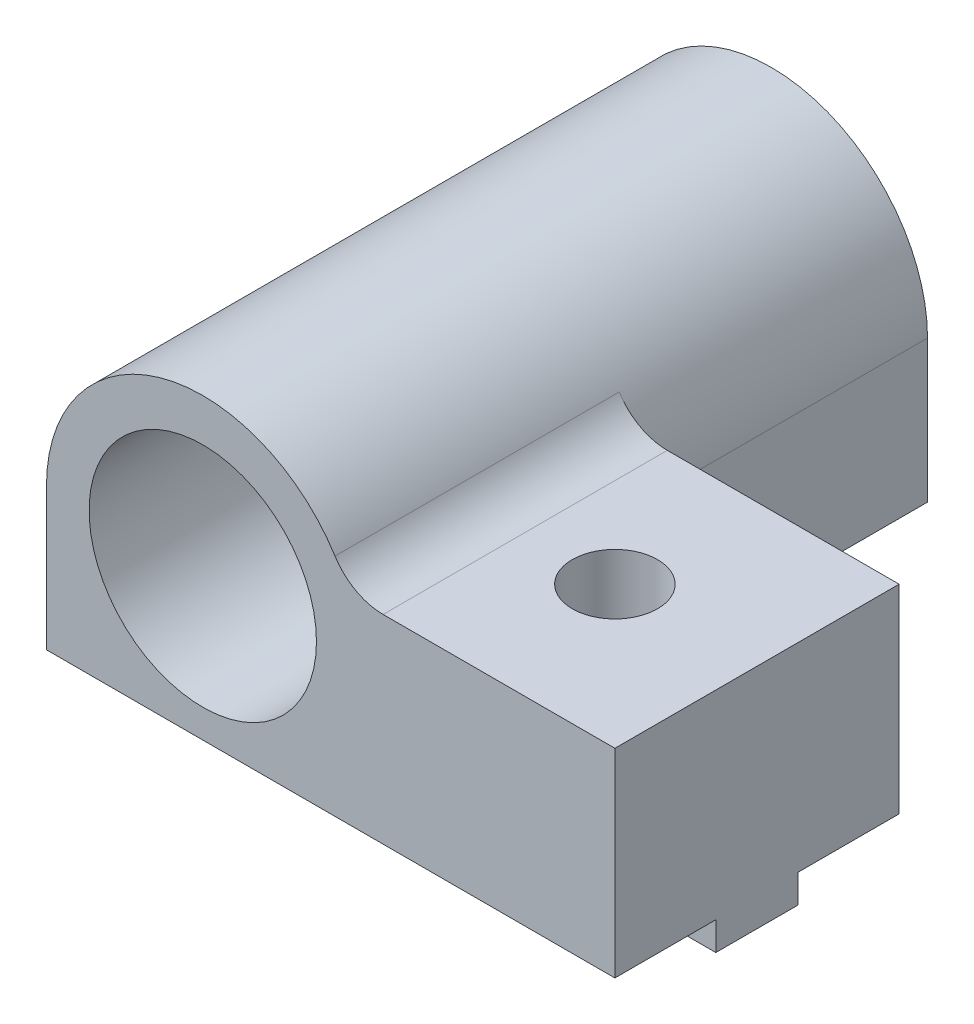
ISO-10303-21;
HEADER;
FILE_DESCRIPTION(('STEP AP214'),'2;1');
FILE_NAME('part.step','',(''),(''),'','','');
FILE_SCHEMA(('AUTOMOTIVE_DESIGN { 1 0 10303 214 1 1 1 1 }'));
ENDSEC;
DATA;
#1=APPLICATION_CONTEXT('core data for automotive mechanical design processes');
#2=APPLICATION_PROTOCOL_DEFINITION('international standard','automotive_design',2000,#1);
#3=PRODUCT_CONTEXT('',#1,'mechanical');
#4=PRODUCT('Part','Part','',(#3));
#5=PRODUCT_RELATED_PRODUCT_CATEGORY('part','',(#4));
#6=PRODUCT_DEFINITION_FORMATION('','',#4);
#7=PRODUCT_DEFINITION_CONTEXT('part definition',#1,'design');
#8=PRODUCT_DEFINITION('design','',#6,#7);
#9=PRODUCT_DEFINITION_SHAPE('','',#8);
#10=(LENGTH_UNIT() NAMED_UNIT(*) SI_UNIT(.MILLI.,.METRE.));
#11=(NAMED_UNIT(*) PLANE_ANGLE_UNIT() SI_UNIT($,.RADIAN.));
#12=(NAMED_UNIT(*) SI_UNIT($,.STERADIAN.) SOLID_ANGLE_UNIT());
#13=UNCERTAINTY_MEASURE_WITH_UNIT(LENGTH_MEASURE(1.E-05),#10,'distance_accuracy_value','');
#14=(GEOMETRIC_REPRESENTATION_CONTEXT(3) GLOBAL_UNCERTAINTY_ASSIGNED_CONTEXT((#13)) GLOBAL_UNIT_ASSIGNED_CONTEXT((#10,
#11,#12)) REPRESENTATION_CONTEXT('',''));
#15=CARTESIAN_POINT('',(0.,0.,0.));
#16=DIRECTION('',(0.,0.,1.));
#17=DIRECTION('',(1.,0.,0.));
#18=AXIS2_PLACEMENT_3D('',#15,#16,#17);
#19=CARTESIAN_POINT('',(0.,0.,-20.));
#20=DIRECTION('',(0.,0.,1.));
#21=DIRECTION('',(-1.,0.,0.));
#22=AXIS2_PLACEMENT_3D('',#19,#20,#21);
#23=PLANE('',#22);
#24=CARTESIAN_POINT('',(0.,0.,-20.));
#25=DIRECTION('',(0.,0.,1.));
#26=DIRECTION('',(1.,0.,0.));
#27=AXIS2_PLACEMENT_3D('',#24,#25,#26);
#28=CIRCLE('',#27,5.5);
#29=CARTESIAN_POINT('',(5.5,0.,-20.));
#30=VERTEX_POINT('',#29);
#31=CARTESIAN_POINT('',(4.65247843149816,2.93333333333333,-20.));
#32=VERTEX_POINT('',#31);
#33=EDGE_CURVE('E160',#30,#32,#28,.T.);
#34=ORIENTED_EDGE('',*,*,#33,.T.);
#35=CARTESIAN_POINT('',(6.34428877022476,4.,-20.));
#36=DIRECTION('',(0.,0.,-1.));
#37=DIRECTION('',(-1.,0.,0.));
#38=AXIS2_PLACEMENT_3D('',#35,#36,#37);
#39=CIRCLE('',#38,2.);
#40=CARTESIAN_POINT('',(6.34428877022476,2.,-20.));
#41=VERTEX_POINT('',#40);
#42=EDGE_CURVE('E11',#41,#32,#39,.T.);
#43=ORIENTED_EDGE('',*,*,#42,.F.);
#44=DIRECTION('',(-1.,0.,0.));
#45=VECTOR('',#44,1.);
#46=CARTESIAN_POINT('',(14.5,2.,-20.));
#47=LINE('',#46,#45);
#48=CARTESIAN_POINT('',(14.5,2.,-20.));
#49=VERTEX_POINT('',#48);
#50=EDGE_CURVE('E211',#49,#41,#47,.T.);
#51=ORIENTED_EDGE('',*,*,#50,.F.);
#52=DIRECTION('',(0.,1.,0.));
#53=VECTOR('',#52,1.);
#54=CARTESIAN_POINT('',(14.5,-5.,-20.));
#55=LINE('',#54,#53);
#56=CARTESIAN_POINT('',(14.5,-5.,-20.));
#57=VERTEX_POINT('',#56);
#58=EDGE_CURVE('E205',#57,#49,#55,.T.);
#59=ORIENTED_EDGE('',*,*,#58,.F.);
#60=DIRECTION('',(1.,0.,0.));
#61=VECTOR('',#60,1.);
#62=CARTESIAN_POINT('',(-5.5,-5.,-20.));
#63=LINE('',#62,#61);
#64=CARTESIAN_POINT('',(5.5,-5.,-20.));
#65=VERTEX_POINT('',#64);
#66=EDGE_CURVE('E217',#65,#57,#63,.T.);
#67=ORIENTED_EDGE('',*,*,#66,.F.);
#68=DIRECTION('',(0.,1.,0.));
#69=VECTOR('',#68,1.);
#70=CARTESIAN_POINT('',(5.5,0.,-20.));
#71=LINE('',#70,#69);
#72=EDGE_CURVE('E279',#65,#30,#71,.T.);
#73=ORIENTED_EDGE('',*,*,#72,.T.);
#74=EDGE_LOOP('',(#34,#43,#51,#59,#67,#73));
#75=FACE_BOUND('',#74,.T.);
#76=ADVANCED_FACE('F33',(#75),#23,.F.);
#77=CARTESIAN_POINT('',(-5.5,-6.,-13.55));
#78=DIRECTION('',(0.,0.,-1.));
#79=DIRECTION('',(1.,0.,0.));
#80=AXIS2_PLACEMENT_3D('',#77,#78,#79);
#81=PLANE('',#80);
#82=DIRECTION('',(1.,0.,0.));
#83=VECTOR('',#82,1.);
#84=CARTESIAN_POINT('',(-5.5,-6.,-13.55));
#85=LINE('',#84,#83);
#86=CARTESIAN_POINT('',(9.88405728739344,-6.,-13.55));
#87=VERTEX_POINT('',#86);
#88=CARTESIAN_POINT('',(14.5,-6.,-13.55));
#89=VERTEX_POINT('',#88);
#90=EDGE_CURVE('E250',#87,#89,#85,.T.);
#91=ORIENTED_EDGE('',*,*,#90,.T.);
#92=DIRECTION('',(0.,1.,0.));
#93=VECTOR('',#92,1.);
#94=CARTESIAN_POINT('',(14.5,-6.,-13.55));
#95=LINE('',#94,#93);
#96=CARTESIAN_POINT('',(14.5,-5.,-13.55));
#97=VERTEX_POINT('',#96);
#98=EDGE_CURVE('E225',#89,#97,#95,.T.);
#99=ORIENTED_EDGE('',*,*,#98,.T.);
#100=DIRECTION('',(1.,0.,0.));
#101=VECTOR('',#100,1.);
#102=CARTESIAN_POINT('',(-5.5,-5.,-13.55));
#103=LINE('',#102,#101);
#104=CARTESIAN_POINT('',(9.88405728739344,-5.,-13.55));
#105=VERTEX_POINT('',#104);
#106=EDGE_CURVE('E240',#105,#97,#103,.T.);
#107=ORIENTED_EDGE('',*,*,#106,.F.);
#108=DIRECTION('',(0.,1.,0.));
#109=VECTOR('',#108,1.);
#110=CARTESIAN_POINT('',(9.88405728739344,-6.,-13.55));
#111=LINE('',#110,#109);
#112=EDGE_CURVE('E253',#87,#105,#111,.T.);
#113=ORIENTED_EDGE('',*,*,#112,.F.);
#114=EDGE_LOOP('',(#91,#99,#107,#113));
#115=FACE_BOUND('',#114,.T.);
#116=ADVANCED_FACE('F301',(#115),#81,.F.);
#117=CARTESIAN_POINT('',(-5.5,-6.,-16.45));
#118=DIRECTION('',(0.,0.,1.));
#119=DIRECTION('',(-1.,0.,0.));
#120=AXIS2_PLACEMENT_3D('',#117,#118,#119);
#121=PLANE('',#120);
#122=DIRECTION('',(-1.,0.,0.));
#123=VECTOR('',#122,1.);
#124=CARTESIAN_POINT('',(-5.5,-6.,-16.45));
#125=LINE('',#124,#123);
#126=CARTESIAN_POINT('',(9.11594271260658,-6.,-16.45));
#127=VERTEX_POINT('',#126);
#128=CARTESIAN_POINT('',(-5.5,-6.,-16.45));
#129=VERTEX_POINT('',#128);
#130=EDGE_CURVE('E243',#127,#129,#125,.T.);
#131=ORIENTED_EDGE('',*,*,#130,.T.);
#132=DIRECTION('',(0.,1.,0.));
#133=VECTOR('',#132,1.);
#134=CARTESIAN_POINT('',(-5.5,-6.,-16.45));
#135=LINE('',#134,#133);
#136=CARTESIAN_POINT('',(-5.5,-5.,-16.45));
#137=VERTEX_POINT('',#136);
#138=EDGE_CURVE('E230',#129,#137,#135,.T.);
#139=ORIENTED_EDGE('',*,*,#138,.T.);
#140=DIRECTION('',(-1.,0.,0.));
#141=VECTOR('',#140,1.);
#142=CARTESIAN_POINT('',(-5.5,-5.,-16.45));
#143=LINE('',#142,#141);
#144=CARTESIAN_POINT('',(9.11594271260658,-5.,-16.45));
#145=VERTEX_POINT('',#144);
#146=EDGE_CURVE('E168',#145,#137,#143,.T.);
#147=ORIENTED_EDGE('',*,*,#146,.F.);
#148=DIRECTION('',(0.,1.,0.));
#149=VECTOR('',#148,1.);
#150=CARTESIAN_POINT('',(9.11594271260658,-6.,-16.45));
#151=LINE('',#150,#149);
#152=EDGE_CURVE('E262',#127,#145,#151,.T.);
#153=ORIENTED_EDGE('',*,*,#152,.F.);
#154=EDGE_LOOP('',(#131,#139,#147,#153));
#155=FACE_BOUND('',#154,.T.);
#156=ADVANCED_FACE('F309',(#155),#121,.F.);
#157=CARTESIAN_POINT('',(0.,-6.,-10.));
#158=DIRECTION('',(0.,-1.,0.));
#159=DIRECTION('',(0.,0.,1.));
#160=AXIS2_PLACEMENT_3D('',#157,#158,#159);
#161=PLANE('',#160);
#162=CARTESIAN_POINT('',(9.50000000000001,-6.,-15.));
#163=DIRECTION('',(0.,1.,0.));
#164=DIRECTION('',(0.,0.,1.));
#165=AXIS2_PLACEMENT_3D('',#162,#163,#164);
#166=CIRCLE('',#165,1.5);
#167=CARTESIAN_POINT('',(9.88405728739344,-6.,-16.45));
#168=VERTEX_POINT('',#167);
#169=EDGE_CURVE('E180',#87,#168,#166,.T.);
#170=ORIENTED_EDGE('',*,*,#169,.T.);
#171=CARTESIAN_POINT('',(14.5,-6.,-16.45));
#172=VERTEX_POINT('',#171);
#173=EDGE_CURVE('E232',#172,#168,#125,.T.);
#174=ORIENTED_EDGE('',*,*,#173,.F.);
#175=DIRECTION('',(0.,0.,-1.));
#176=VECTOR('',#175,1.);
#177=CARTESIAN_POINT('',(14.5,-6.,-16.45));
#178=LINE('',#177,#176);
#179=EDGE_CURVE('E244',#89,#172,#178,.T.);
#180=ORIENTED_EDGE('',*,*,#179,.F.);
#181=ORIENTED_EDGE('',*,*,#90,.F.);
#182=EDGE_LOOP('',(#170,#174,#180,#181));
#183=FACE_BOUND('',#182,.T.);
#184=ADVANCED_FACE('F318',(#183),#161,.T.);
#185=CARTESIAN_POINT('',(-5.5,-5.,-20.));
#186=DIRECTION('',(0.,1.,0.));
#187=DIRECTION('',(0.,0.,-1.));
#188=AXIS2_PLACEMENT_3D('',#185,#186,#187);
#189=PLANE('',#188);
#190=ORIENTED_EDGE('',*,*,#146,.T.);
#191=DIRECTION('',(0.,0.,1.));
#192=VECTOR('',#191,1.);
#193=CARTESIAN_POINT('',(-5.5,-5.,-20.));
#194=LINE('',#193,#192);
#195=CARTESIAN_POINT('',(-5.5,-5.,-30.));
#196=VERTEX_POINT('',#195);
#197=EDGE_CURVE('E153',#196,#137,#194,.T.);
#198=ORIENTED_EDGE('',*,*,#197,.F.);
#199=DIRECTION('',(1.,0.,0.));
#200=VECTOR('',#199,1.);
#201=CARTESIAN_POINT('',(-5.5,-5.,-30.));
#202=LINE('',#201,#200);
#203=CARTESIAN_POINT('',(5.5,-5.,-30.));
#204=VERTEX_POINT('',#203);
#205=EDGE_CURVE('E159',#196,#204,#202,.T.);
#206=ORIENTED_EDGE('',*,*,#205,.T.);
#207=DIRECTION('',(0.,0.,1.));
#208=VECTOR('',#207,1.);
#209=CARTESIAN_POINT('',(5.5,-5.,-30.));
#210=LINE('',#209,#208);
#211=EDGE_CURVE('E48',#204,#65,#210,.T.);
#212=ORIENTED_EDGE('',*,*,#211,.T.);
#213=ORIENTED_EDGE('',*,*,#66,.T.);
#214=DIRECTION('',(0.,0.,1.));
#215=VECTOR('',#214,1.);
#216=CARTESIAN_POINT('',(14.5,-5.,-20.));
#217=LINE('',#216,#215);
#218=CARTESIAN_POINT('',(14.5,-5.,-16.45));
#219=VERTEX_POINT('',#218);
#220=EDGE_CURVE('E175',#57,#219,#217,.T.);
#221=ORIENTED_EDGE('',*,*,#220,.T.);
#222=CARTESIAN_POINT('',(9.88405728739344,-5.,-16.45));
#223=VERTEX_POINT('',#222);
#224=EDGE_CURVE('E233',#219,#223,#143,.T.);
#225=ORIENTED_EDGE('',*,*,#224,.T.);
#226=CARTESIAN_POINT('',(9.50000000000001,-5.,-15.));
#227=DIRECTION('',(0.,-1.,0.));
#228=DIRECTION('',(0.,0.,-1.));
#229=AXIS2_PLACEMENT_3D('',#226,#227,#228);
#230=CIRCLE('',#229,1.5);
#231=EDGE_CURVE('E265',#145,#223,#230,.T.);
#232=ORIENTED_EDGE('',*,*,#231,.F.);
#233=EDGE_LOOP('',(#190,#198,#206,#212,#213,#221,#225,#232));
#234=FACE_BOUND('',#233,.T.);
#235=ADVANCED_FACE('F166',(#234),#189,.F.);
#236=ORIENTED_EDGE('',*,*,#106,.T.);
#237=CARTESIAN_POINT('',(14.5,-5.,-10.));
#238=VERTEX_POINT('',#237);
#239=EDGE_CURVE('E213',#97,#238,#217,.T.);
#240=ORIENTED_EDGE('',*,*,#239,.T.);
#241=DIRECTION('',(1.,0.,0.));
#242=VECTOR('',#241,1.);
#243=CARTESIAN_POINT('',(-5.5,-5.,-10.));
#244=LINE('',#243,#242);
#245=CARTESIAN_POINT('',(-5.5,-5.,-10.));
#246=VERTEX_POINT('',#245);
#247=EDGE_CURVE('E209',#246,#238,#244,.T.);
#248=ORIENTED_EDGE('',*,*,#247,.F.);
#249=CARTESIAN_POINT('',(-5.5,-5.,-13.55));
#250=VERTEX_POINT('',#249);
#251=EDGE_CURVE('E170',#250,#246,#194,.T.);
#252=ORIENTED_EDGE('',*,*,#251,.F.);
#253=CARTESIAN_POINT('',(9.11594271260657,-5.,-13.55));
#254=VERTEX_POINT('',#253);
#255=EDGE_CURVE('E237',#250,#254,#103,.T.);
#256=ORIENTED_EDGE('',*,*,#255,.T.);
#257=CARTESIAN_POINT('',(9.50000000000001,-5.,-15.));
#258=DIRECTION('',(0.,-1.,0.));
#259=DIRECTION('',(0.,0.,-1.));
#260=AXIS2_PLACEMENT_3D('',#257,#258,#259);
#261=CIRCLE('',#260,1.5);
#262=EDGE_CURVE('E256',#105,#254,#261,.T.);
#263=ORIENTED_EDGE('',*,*,#262,.F.);
#264=EDGE_LOOP('',(#236,#240,#248,#252,#256,#263));
#265=FACE_BOUND('',#264,.T.);
#266=ADVANCED_FACE('F314',(#265),#189,.F.);
#267=CARTESIAN_POINT('',(0.,0.,-10.));
#268=DIRECTION('',(0.,0.,1.));
#269=DIRECTION('',(-1.,0.,0.));
#270=AXIS2_PLACEMENT_3D('',#267,#268,#269);
#271=PLANE('',#270);
#272=DIRECTION('',(-1.,0.,0.));
#273=VECTOR('',#272,1.);
#274=CARTESIAN_POINT('',(14.5,2.,-10.));
#275=LINE('',#274,#273);
#276=CARTESIAN_POINT('',(14.5,2.,-10.));
#277=VERTEX_POINT('',#276);
#278=CARTESIAN_POINT('',(6.34428877022476,2.,-10.));
#279=VERTEX_POINT('',#278);
#280=EDGE_CURVE('E190',#277,#279,#275,.T.);
#281=ORIENTED_EDGE('',*,*,#280,.T.);
#282=CARTESIAN_POINT('',(6.34428877022476,4.,-10.));
#283=DIRECTION('',(0.,0.,-1.));
#284=DIRECTION('',(-1.,0.,0.));
#285=AXIS2_PLACEMENT_3D('',#282,#283,#284);
#286=CIRCLE('',#285,2.);
#287=CARTESIAN_POINT('',(4.65247843149816,2.93333333333333,-10.));
#288=VERTEX_POINT('',#287);
#289=EDGE_CURVE('E41',#288,#279,#286,.F.);
#290=ORIENTED_EDGE('',*,*,#289,.F.);
#291=CARTESIAN_POINT('',(0.,0.,-10.));
#292=DIRECTION('',(0.,0.,1.));
#293=DIRECTION('',(-1.,0.,0.));
#294=AXIS2_PLACEMENT_3D('',#291,#292,#293);
#295=CIRCLE('',#294,5.5);
#296=CARTESIAN_POINT('',(-5.5,0.,-10.));
#297=VERTEX_POINT('',#296);
#298=EDGE_CURVE('E196',#288,#297,#295,.T.);
#299=ORIENTED_EDGE('',*,*,#298,.T.);
#300=DIRECTION('',(0.,-1.,0.));
#301=VECTOR('',#300,1.);
#302=CARTESIAN_POINT('',(-5.5,0.,-10.));
#303=LINE('',#302,#301);
#304=EDGE_CURVE('E199',#297,#246,#303,.T.);
#305=ORIENTED_EDGE('',*,*,#304,.T.);
#306=ORIENTED_EDGE('',*,*,#247,.T.);
#307=DIRECTION('',(0.,1.,0.));
#308=VECTOR('',#307,1.);
#309=CARTESIAN_POINT('',(14.5,-5.,-10.));
#310=LINE('',#309,#308);
#311=EDGE_CURVE('E194',#238,#277,#310,.T.);
#312=ORIENTED_EDGE('',*,*,#311,.T.);
#313=EDGE_LOOP('',(#281,#290,#299,#305,#306,#312));
#314=FACE_BOUND('',#313,.T.);
#315=CARTESIAN_POINT('',(0.,0.,-10.));
#316=DIRECTION('',(0.,0.,1.));
#317=DIRECTION('',(1.,0.,0.));
#318=AXIS2_PLACEMENT_3D('',#315,#316,#317);
#319=CIRCLE('',#318,4.);
#320=CARTESIAN_POINT('',(4.,0.,-10.));
#321=VERTEX_POINT('',#320);
#322=EDGE_CURVE('E197',#321,#321,#319,.T.);
#323=ORIENTED_EDGE('',*,*,#322,.F.);
#324=EDGE_LOOP('',(#323));
#325=FACE_BOUND('',#324,.T.);
#326=ADVANCED_FACE('F191',(#314,#325),#271,.T.);
#327=CARTESIAN_POINT('',(14.5,2.,-20.));
#328=DIRECTION('',(0.,-1.,0.));
#329=DIRECTION('',(1.,0.,0.));
#330=AXIS2_PLACEMENT_3D('',#327,#328,#329);
#331=PLANE('',#330);
#332=CARTESIAN_POINT('',(9.50000000000001,2.,-15.));
#333=DIRECTION('',(0.,-1.,0.));
#334=DIRECTION('',(-1.,0.,0.));
#335=AXIS2_PLACEMENT_3D('',#332,#333,#334);
#336=CIRCLE('',#335,1.5);
#337=CARTESIAN_POINT('',(8.,2.,-15.));
#338=VERTEX_POINT('',#337);
#339=EDGE_CURVE('E270',#338,#338,#336,.T.);
#340=ORIENTED_EDGE('',*,*,#339,.T.);
#341=EDGE_LOOP('',(#340));
#342=FACE_BOUND('',#341,.T.);
#343=ORIENTED_EDGE('',*,*,#280,.F.);
#344=DIRECTION('',(0.,0.,1.));
#345=VECTOR('',#344,1.);
#346=CARTESIAN_POINT('',(14.5,2.,-20.));
#347=LINE('',#346,#345);
#348=EDGE_CURVE('E212',#49,#277,#347,.T.);
#349=ORIENTED_EDGE('',*,*,#348,.F.);
#350=ORIENTED_EDGE('',*,*,#50,.T.);
#351=DIRECTION('',(0.,0.,-1.));
#352=VECTOR('',#351,1.);
#353=CARTESIAN_POINT('',(6.34428877022476,2.,-20.));
#354=LINE('',#353,#352);
#355=EDGE_CURVE('E55',#279,#41,#354,.T.);
#356=ORIENTED_EDGE('',*,*,#355,.F.);
#357=EDGE_LOOP('',(#343,#349,#350,#356));
#358=FACE_BOUND('',#357,.T.);
#359=ADVANCED_FACE('F313',(#342,#358),#331,.F.);
#360=CARTESIAN_POINT('',(0.,0.,-20.));
#361=DIRECTION('',(0.,0.,1.));
#362=DIRECTION('',(-1.,0.,0.));
#363=AXIS2_PLACEMENT_3D('',#360,#361,#362);
#364=CYLINDRICAL_SURFACE('',#363,5.5);
#365=DIRECTION('',(0.,0.,1.));
#366=VECTOR('',#365,1.);
#367=CARTESIAN_POINT('',(-5.5,0.,-20.));
#368=LINE('',#367,#366);
#369=CARTESIAN_POINT('',(-5.5,0.,-30.));
#370=VERTEX_POINT('',#369);
#371=EDGE_CURVE('E155',#370,#297,#368,.T.);
#372=ORIENTED_EDGE('',*,*,#371,.T.);
#373=ORIENTED_EDGE('',*,*,#298,.F.);
#374=DIRECTION('',(0.,0.,1.));
#375=VECTOR('',#374,1.);
#376=CARTESIAN_POINT('',(4.65247843149816,2.93333333333333,-20.));
#377=LINE('',#376,#375);
#378=EDGE_CURVE('E181',#32,#288,#377,.T.);
#379=ORIENTED_EDGE('',*,*,#378,.F.);
#380=ORIENTED_EDGE('',*,*,#33,.F.);
#381=DIRECTION('',(0.,0.,1.));
#382=VECTOR('',#381,1.);
#383=CARTESIAN_POINT('',(5.5,0.,-30.));
#384=LINE('',#383,#382);
#385=CARTESIAN_POINT('',(5.5,0.,-30.));
#386=VERTEX_POINT('',#385);
#387=EDGE_CURVE('E274',#386,#30,#384,.T.);
#388=ORIENTED_EDGE('',*,*,#387,.F.);
#389=CARTESIAN_POINT('',(0.,0.,-30.));
#390=DIRECTION('',(0.,0.,1.));
#391=DIRECTION('',(1.,0.,0.));
#392=AXIS2_PLACEMENT_3D('',#389,#390,#391);
#393=CIRCLE('',#392,5.5);
#394=EDGE_CURVE('E276',#386,#370,#393,.T.);
#395=ORIENTED_EDGE('',*,*,#394,.T.);
#396=EDGE_LOOP('',(#372,#373,#379,#380,#388,#395));
#397=FACE_BOUND('',#396,.T.);
#398=ADVANCED_FACE('F321',(#397),#364,.T.);
#399=CARTESIAN_POINT('',(-5.5,0.,-20.));
#400=DIRECTION('',(1.,0.,0.));
#401=DIRECTION('',(0.,1.,0.));
#402=AXIS2_PLACEMENT_3D('',#399,#400,#401);
#403=PLANE('',#402);
#404=ORIENTED_EDGE('',*,*,#304,.F.);
#405=ORIENTED_EDGE('',*,*,#371,.F.);
#406=DIRECTION('',(0.,-1.,0.));
#407=VECTOR('',#406,1.);
#408=CARTESIAN_POINT('',(-5.5,-5.,-30.));
#409=LINE('',#408,#407);
#410=EDGE_CURVE('E147',#370,#196,#409,.T.);
#411=ORIENTED_EDGE('',*,*,#410,.T.);
#412=ORIENTED_EDGE('',*,*,#197,.T.);
#413=ORIENTED_EDGE('',*,*,#138,.F.);
#414=DIRECTION('',(0.,0.,1.));
#415=VECTOR('',#414,1.);
#416=CARTESIAN_POINT('',(-5.5,-6.,-16.45));
#417=LINE('',#416,#415);
#418=CARTESIAN_POINT('',(-5.5,-6.,-13.55));
#419=VERTEX_POINT('',#418);
#420=EDGE_CURVE('E236',#129,#419,#417,.T.);
#421=ORIENTED_EDGE('',*,*,#420,.T.);
#422=DIRECTION('',(0.,1.,0.));
#423=VECTOR('',#422,1.);
#424=CARTESIAN_POINT('',(-5.5,-6.,-13.55));
#425=LINE('',#424,#423);
#426=EDGE_CURVE('E202',#419,#250,#425,.T.);
#427=ORIENTED_EDGE('',*,*,#426,.T.);
#428=ORIENTED_EDGE('',*,*,#251,.T.);
#429=EDGE_LOOP('',(#404,#405,#411,#412,#413,#421,#427,#428));
#430=FACE_BOUND('',#429,.T.);
#431=ADVANCED_FACE('F150',(#430),#403,.F.);
#432=CARTESIAN_POINT('',(14.5,-5.,-20.));
#433=DIRECTION('',(-1.,0.,0.));
#434=DIRECTION('',(0.,-1.,0.));
#435=AXIS2_PLACEMENT_3D('',#432,#433,#434);
#436=PLANE('',#435);
#437=ORIENTED_EDGE('',*,*,#311,.F.);
#438=ORIENTED_EDGE('',*,*,#239,.F.);
#439=ORIENTED_EDGE('',*,*,#98,.F.);
#440=ORIENTED_EDGE('',*,*,#179,.T.);
#441=DIRECTION('',(0.,1.,0.));
#442=VECTOR('',#441,1.);
#443=CARTESIAN_POINT('',(14.5,-6.,-16.45));
#444=LINE('',#443,#442);
#445=EDGE_CURVE('E228',#172,#219,#444,.T.);
#446=ORIENTED_EDGE('',*,*,#445,.T.);
#447=ORIENTED_EDGE('',*,*,#220,.F.);
#448=ORIENTED_EDGE('',*,*,#58,.T.);
#449=ORIENTED_EDGE('',*,*,#348,.T.);
#450=EDGE_LOOP('',(#437,#438,#439,#440,#446,#447,#448,#449));
#451=FACE_BOUND('',#450,.T.);
#452=ADVANCED_FACE('F291',(#451),#436,.F.);
#453=CARTESIAN_POINT('',(0.,0.,-20.));
#454=DIRECTION('',(0.,0.,1.));
#455=DIRECTION('',(-1.,0.,0.));
#456=AXIS2_PLACEMENT_3D('',#453,#454,#455);
#457=CYLINDRICAL_SURFACE('',#456,4.);
#458=ORIENTED_EDGE('',*,*,#322,.T.);
#459=EDGE_LOOP('',(#458));
#460=FACE_BOUND('',#459,.T.);
#461=CARTESIAN_POINT('',(0.,0.,-30.));
#462=DIRECTION('',(0.,0.,1.));
#463=DIRECTION('',(1.,0.,0.));
#464=AXIS2_PLACEMENT_3D('',#461,#462,#463);
#465=CIRCLE('',#464,4.);
#466=CARTESIAN_POINT('',(4.,0.,-30.));
#467=VERTEX_POINT('',#466);
#468=EDGE_CURVE('E282',#467,#467,#465,.T.);
#469=ORIENTED_EDGE('',*,*,#468,.F.);
#470=EDGE_LOOP('',(#469));
#471=FACE_BOUND('',#470,.T.);
#472=ADVANCED_FACE('F288',(#460,#471),#457,.F.);
#473=ORIENTED_EDGE('',*,*,#255,.F.);
#474=ORIENTED_EDGE('',*,*,#426,.F.);
#475=CARTESIAN_POINT('',(9.11594271260657,-6.,-13.55));
#476=VERTEX_POINT('',#475);
#477=EDGE_CURVE('E247',#419,#476,#85,.T.);
#478=ORIENTED_EDGE('',*,*,#477,.T.);
#479=DIRECTION('',(0.,1.,0.));
#480=VECTOR('',#479,1.);
#481=CARTESIAN_POINT('',(9.11594271260657,-6.,-13.55));
#482=LINE('',#481,#480);
#483=EDGE_CURVE('E259',#254,#476,#482,.F.);
#484=ORIENTED_EDGE('',*,*,#483,.F.);
#485=EDGE_LOOP('',(#473,#474,#478,#484));
#486=FACE_BOUND('',#485,.T.);
#487=ADVANCED_FACE('F290',(#486),#81,.F.);
#488=ORIENTED_EDGE('',*,*,#224,.F.);
#489=ORIENTED_EDGE('',*,*,#445,.F.);
#490=ORIENTED_EDGE('',*,*,#173,.T.);
#491=DIRECTION('',(0.,1.,0.));
#492=VECTOR('',#491,1.);
#493=CARTESIAN_POINT('',(9.88405728739344,-6.,-16.45));
#494=LINE('',#493,#492);
#495=EDGE_CURVE('E268',#223,#168,#494,.F.);
#496=ORIENTED_EDGE('',*,*,#495,.F.);
#497=EDGE_LOOP('',(#488,#489,#490,#496));
#498=FACE_BOUND('',#497,.T.);
#499=ADVANCED_FACE('F298',(#498),#121,.F.);
#500=EDGE_CURVE('E172',#127,#476,#166,.T.);
#501=ORIENTED_EDGE('',*,*,#500,.T.);
#502=ORIENTED_EDGE('',*,*,#477,.F.);
#503=ORIENTED_EDGE('',*,*,#420,.F.);
#504=ORIENTED_EDGE('',*,*,#130,.F.);
#505=EDGE_LOOP('',(#501,#502,#503,#504));
#506=FACE_BOUND('',#505,.T.);
#507=ADVANCED_FACE('F333',(#506),#161,.T.);
#508=CARTESIAN_POINT('',(9.50000000000001,-6.,-15.));
#509=DIRECTION('',(0.,1.,0.));
#510=DIRECTION('',(-1.,0.,0.));
#511=AXIS2_PLACEMENT_3D('',#508,#509,#510);
#512=CYLINDRICAL_SURFACE('',#511,1.5);
#513=ORIENTED_EDGE('',*,*,#339,.F.);
#514=EDGE_LOOP('',(#513));
#515=FACE_BOUND('',#514,.T.);
#516=ORIENTED_EDGE('',*,*,#169,.F.);
#517=ORIENTED_EDGE('',*,*,#112,.T.);
#518=ORIENTED_EDGE('',*,*,#262,.T.);
#519=ORIENTED_EDGE('',*,*,#483,.T.);
#520=ORIENTED_EDGE('',*,*,#500,.F.);
#521=ORIENTED_EDGE('',*,*,#152,.T.);
#522=ORIENTED_EDGE('',*,*,#231,.T.);
#523=ORIENTED_EDGE('',*,*,#495,.T.);
#524=EDGE_LOOP('',(#516,#517,#518,#519,#520,#521,#522,#523));
#525=FACE_BOUND('',#524,.T.);
#526=ADVANCED_FACE('F330',(#515,#525),#512,.F.);
#527=CARTESIAN_POINT('',(6.34428877022476,4.,-20.));
#528=DIRECTION('',(0.,0.,1.));
#529=DIRECTION('',(-1.,0.,0.));
#530=AXIS2_PLACEMENT_3D('',#527,#528,#529);
#531=CYLINDRICAL_SURFACE('',#530,2.);
#532=ORIENTED_EDGE('',*,*,#42,.T.);
#533=ORIENTED_EDGE('',*,*,#378,.T.);
#534=ORIENTED_EDGE('',*,*,#289,.T.);
#535=ORIENTED_EDGE('',*,*,#355,.T.);
#536=EDGE_LOOP('',(#532,#533,#534,#535));
#537=FACE_BOUND('',#536,.T.);
#538=ADVANCED_FACE('F35',(#537),#531,.F.);
#539=CARTESIAN_POINT('',(0.,0.,-30.));
#540=DIRECTION('',(0.,0.,-1.));
#541=DIRECTION('',(1.,0.,0.));
#542=AXIS2_PLACEMENT_3D('',#539,#540,#541);
#543=PLANE('',#542);
#544=ORIENTED_EDGE('',*,*,#410,.F.);
#545=ORIENTED_EDGE('',*,*,#394,.F.);
#546=DIRECTION('',(0.,1.,0.));
#547=VECTOR('',#546,1.);
#548=CARTESIAN_POINT('',(5.5,0.,-30.));
#549=LINE('',#548,#547);
#550=EDGE_CURVE('E164',#204,#386,#549,.T.);
#551=ORIENTED_EDGE('',*,*,#550,.F.);
#552=ORIENTED_EDGE('',*,*,#205,.F.);
#553=EDGE_LOOP('',(#544,#545,#551,#552));
#554=FACE_BOUND('',#553,.T.);
#555=ORIENTED_EDGE('',*,*,#468,.T.);
#556=EDGE_LOOP('',(#555));
#557=FACE_BOUND('',#556,.T.);
#558=ADVANCED_FACE('F162',(#554,#557),#543,.T.);
#559=CARTESIAN_POINT('',(5.5,0.,-30.));
#560=DIRECTION('',(-1.,0.,0.));
#561=DIRECTION('',(0.,0.,-1.));
#562=AXIS2_PLACEMENT_3D('',#559,#560,#561);
#563=PLANE('',#562);
#564=ORIENTED_EDGE('',*,*,#72,.F.);
#565=ORIENTED_EDGE('',*,*,#211,.F.);
#566=ORIENTED_EDGE('',*,*,#550,.T.);
#567=ORIENTED_EDGE('',*,*,#387,.T.);
#568=EDGE_LOOP('',(#564,#565,#566,#567));
#569=FACE_BOUND('',#568,.T.);
#570=ADVANCED_FACE('F369',(#569),#563,.F.);
#571=CLOSED_SHELL('',(#76,#116,#156,#184,#235,#266,#326,#359,#398,#431,#452,#472,#487,#499,#507,
#526,#538,#558,#570));
#572=MANIFOLD_SOLID_BREP('B2',#571);
#573=ADVANCED_BREP_SHAPE_REPRESENTATION('',(#18,#572),#14);
#574=SHAPE_DEFINITION_REPRESENTATION(#9,#573);
ENDSEC;
END-ISO-10303-21;
